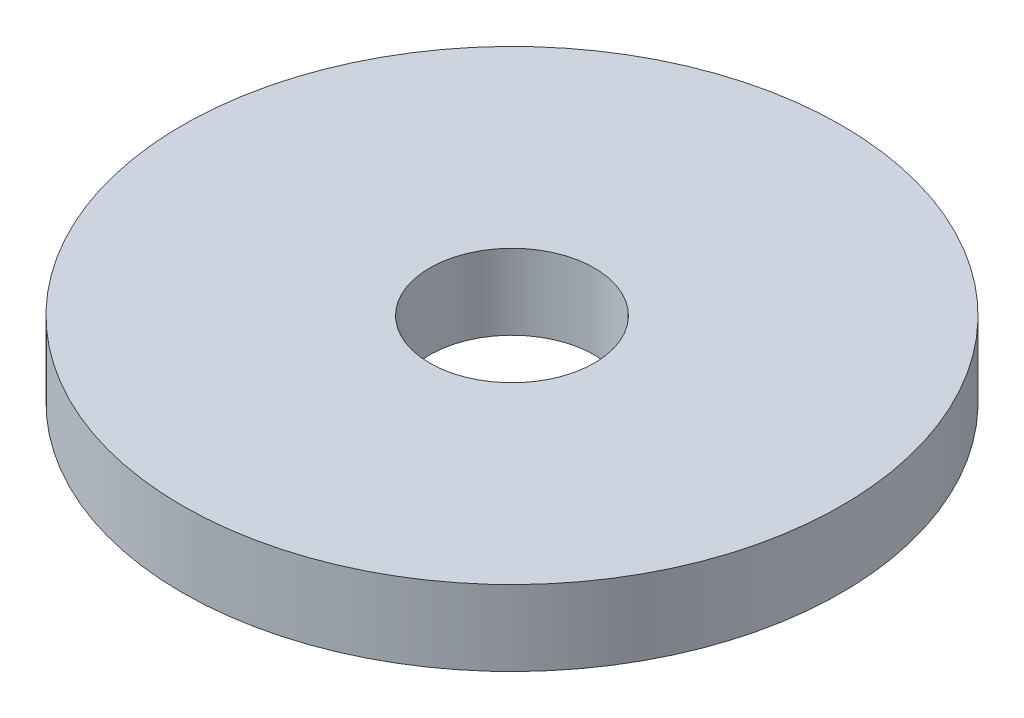
ISO-10303-21;
HEADER;
FILE_DESCRIPTION(('STEP AP214'),'2;1');
FILE_NAME('part.step','',(''),(''),'','','');
FILE_SCHEMA(('AUTOMOTIVE_DESIGN { 1 0 10303 214 1 1 1 1 }'));
ENDSEC;
DATA;
#1=APPLICATION_CONTEXT('core data for automotive mechanical design processes');
#2=APPLICATION_PROTOCOL_DEFINITION('international standard','automotive_design',2000,#1);
#3=PRODUCT_CONTEXT('',#1,'mechanical');
#4=PRODUCT('Part','Part','',(#3));
#5=PRODUCT_RELATED_PRODUCT_CATEGORY('part','',(#4));
#6=PRODUCT_DEFINITION_FORMATION('','',#4);
#7=PRODUCT_DEFINITION_CONTEXT('part definition',#1,'design');
#8=PRODUCT_DEFINITION('design','',#6,#7);
#9=PRODUCT_DEFINITION_SHAPE('','',#8);
#10=(LENGTH_UNIT() NAMED_UNIT(*) SI_UNIT(.MILLI.,.METRE.));
#11=(NAMED_UNIT(*) PLANE_ANGLE_UNIT() SI_UNIT($,.RADIAN.));
#12=(NAMED_UNIT(*) SI_UNIT($,.STERADIAN.) SOLID_ANGLE_UNIT());
#13=UNCERTAINTY_MEASURE_WITH_UNIT(LENGTH_MEASURE(1.E-05),#10,'distance_accuracy_value','');
#14=(GEOMETRIC_REPRESENTATION_CONTEXT(3) GLOBAL_UNCERTAINTY_ASSIGNED_CONTEXT((#13)) GLOBAL_UNIT_ASSIGNED_CONTEXT((#10,
#11,#12)) REPRESENTATION_CONTEXT('',''));
#15=CARTESIAN_POINT('',(0.,0.,0.));
#16=DIRECTION('',(0.,0.,1.));
#17=DIRECTION('',(1.,0.,0.));
#18=AXIS2_PLACEMENT_3D('',#15,#16,#17);
#19=CARTESIAN_POINT('',(0.,16.,0.));
#20=DIRECTION('',(0.,-1.,0.));
#21=DIRECTION('',(0.,0.,-1.));
#22=AXIS2_PLACEMENT_3D('',#19,#20,#21);
#23=CYLINDRICAL_SURFACE('',#22,70.);
#24=CARTESIAN_POINT('',(0.,16.,0.));
#25=DIRECTION('',(0.,1.,0.));
#26=DIRECTION('',(0.,0.,1.));
#27=AXIS2_PLACEMENT_3D('',#24,#25,#26);
#28=CIRCLE('',#27,70.);
#29=CARTESIAN_POINT('',(0.,16.,70.));
#30=VERTEX_POINT('',#29);
#31=EDGE_CURVE('E10',#30,#30,#28,.T.);
#32=ORIENTED_EDGE('',*,*,#31,.F.);
#33=EDGE_LOOP('',(#32));
#34=FACE_BOUND('',#33,.T.);
#35=CARTESIAN_POINT('',(0.,0.,0.));
#36=DIRECTION('',(0.,1.,0.));
#37=DIRECTION('',(0.,0.,1.));
#38=AXIS2_PLACEMENT_3D('',#35,#36,#37);
#39=CIRCLE('',#38,70.);
#40=CARTESIAN_POINT('',(0.,0.,70.));
#41=VERTEX_POINT('',#40);
#42=EDGE_CURVE('E37',#41,#41,#39,.T.);
#43=ORIENTED_EDGE('',*,*,#42,.T.);
#44=EDGE_LOOP('',(#43));
#45=FACE_BOUND('',#44,.T.);
#46=ADVANCED_FACE('F40',(#34,#45),#23,.T.);
#47=CARTESIAN_POINT('',(0.,16.,0.));
#48=DIRECTION('',(0.,1.,0.));
#49=DIRECTION('',(0.,0.,1.));
#50=AXIS2_PLACEMENT_3D('',#47,#48,#49);
#51=PLANE('',#50);
#52=CARTESIAN_POINT('',(0.,16.,0.));
#53=DIRECTION('',(0.,1.,0.));
#54=DIRECTION('',(0.,0.,1.));
#55=AXIS2_PLACEMENT_3D('',#52,#53,#54);
#56=CIRCLE('',#55,17.5);
#57=CARTESIAN_POINT('',(0.,16.,17.5));
#58=VERTEX_POINT('',#57);
#59=EDGE_CURVE('E50',#58,#58,#56,.T.);
#60=ORIENTED_EDGE('',*,*,#59,.F.);
#61=EDGE_LOOP('',(#60));
#62=FACE_BOUND('',#61,.T.);
#63=ORIENTED_EDGE('',*,*,#31,.T.);
#64=EDGE_LOOP('',(#63));
#65=FACE_BOUND('',#64,.T.);
#66=ADVANCED_FACE('F59',(#62,#65),#51,.T.);
#67=CARTESIAN_POINT('',(0.,0.,0.));
#68=DIRECTION('',(0.,1.,0.));
#69=DIRECTION('',(0.,0.,1.));
#70=AXIS2_PLACEMENT_3D('',#67,#68,#69);
#71=PLANE('',#70);
#72=CARTESIAN_POINT('',(0.,0.,0.));
#73=DIRECTION('',(0.,1.,0.));
#74=DIRECTION('',(0.,0.,1.));
#75=AXIS2_PLACEMENT_3D('',#72,#73,#74);
#76=CIRCLE('',#75,17.5);
#77=CARTESIAN_POINT('',(0.,0.,17.5));
#78=VERTEX_POINT('',#77);
#79=EDGE_CURVE('E47',#78,#78,#76,.T.);
#80=ORIENTED_EDGE('',*,*,#79,.T.);
#81=EDGE_LOOP('',(#80));
#82=FACE_BOUND('',#81,.T.);
#83=ORIENTED_EDGE('',*,*,#42,.F.);
#84=EDGE_LOOP('',(#83));
#85=FACE_BOUND('',#84,.T.);
#86=ADVANCED_FACE('F58',(#82,#85),#71,.F.);
#87=CARTESIAN_POINT('',(0.,16.,0.));
#88=DIRECTION('',(0.,-1.,0.));
#89=DIRECTION('',(0.,0.,-1.));
#90=AXIS2_PLACEMENT_3D('',#87,#88,#89);
#91=CYLINDRICAL_SURFACE('',#90,17.5);
#92=ORIENTED_EDGE('',*,*,#59,.T.);
#93=EDGE_LOOP('',(#92));
#94=FACE_BOUND('',#93,.T.);
#95=ORIENTED_EDGE('',*,*,#79,.F.);
#96=EDGE_LOOP('',(#95));
#97=FACE_BOUND('',#96,.T.);
#98=ADVANCED_FACE('F54',(#94,#97),#91,.F.);
#99=CLOSED_SHELL('',(#46,#66,#86,#98));
#100=MANIFOLD_SOLID_BREP('B2',#99);
#101=ADVANCED_BREP_SHAPE_REPRESENTATION('',(#18,#100),#14);
#102=SHAPE_DEFINITION_REPRESENTATION(#9,#101);
ENDSEC;
END-ISO-10303-21;
